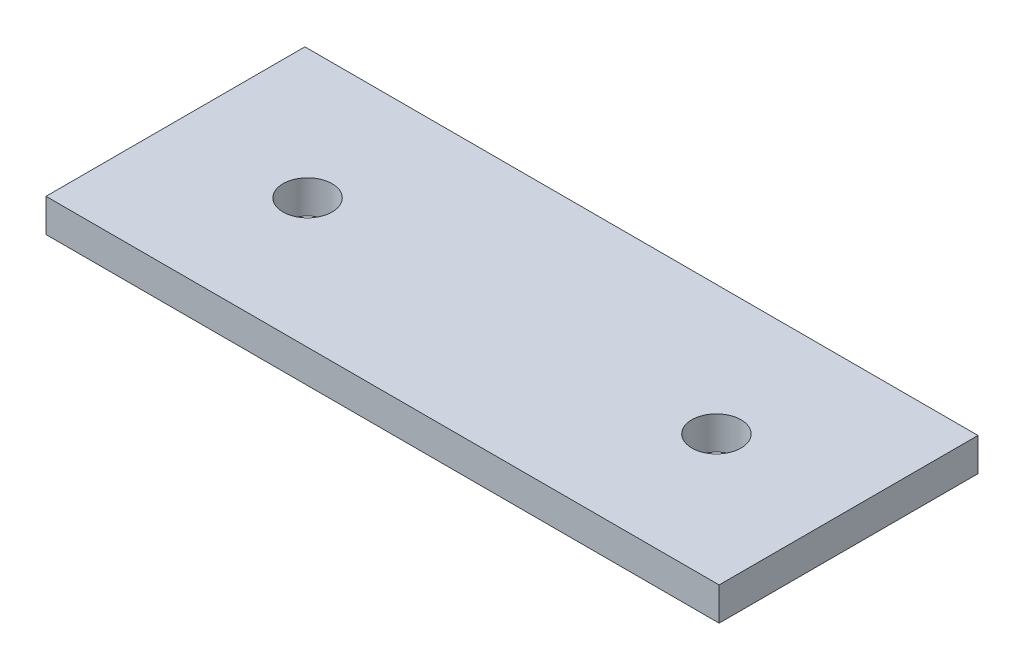
ISO-10303-21;
HEADER;
FILE_DESCRIPTION(('STEP AP214'),'2;1');
FILE_NAME('part.step','',(''),(''),'','','');
FILE_SCHEMA(('AUTOMOTIVE_DESIGN { 1 0 10303 214 1 1 1 1 }'));
ENDSEC;
DATA;
#1=APPLICATION_CONTEXT('core data for automotive mechanical design processes');
#2=APPLICATION_PROTOCOL_DEFINITION('international standard','automotive_design',2000,#1);
#3=PRODUCT_CONTEXT('',#1,'mechanical');
#4=PRODUCT('Part','Part','',(#3));
#5=PRODUCT_RELATED_PRODUCT_CATEGORY('part','',(#4));
#6=PRODUCT_DEFINITION_FORMATION('','',#4);
#7=PRODUCT_DEFINITION_CONTEXT('part definition',#1,'design');
#8=PRODUCT_DEFINITION('design','',#6,#7);
#9=PRODUCT_DEFINITION_SHAPE('','',#8);
#10=(LENGTH_UNIT() NAMED_UNIT(*) SI_UNIT(.MILLI.,.METRE.));
#11=(NAMED_UNIT(*) PLANE_ANGLE_UNIT() SI_UNIT($,.RADIAN.));
#12=(NAMED_UNIT(*) SI_UNIT($,.STERADIAN.) SOLID_ANGLE_UNIT());
#13=UNCERTAINTY_MEASURE_WITH_UNIT(LENGTH_MEASURE(1.E-05),#10,'distance_accuracy_value','');
#14=(GEOMETRIC_REPRESENTATION_CONTEXT(3) GLOBAL_UNCERTAINTY_ASSIGNED_CONTEXT((#13)) GLOBAL_UNIT_ASSIGNED_CONTEXT((#10,
#11,#12)) REPRESENTATION_CONTEXT('',''));
#15=CARTESIAN_POINT('',(0.,0.,0.));
#16=DIRECTION('',(0.,0.,1.));
#17=DIRECTION('',(1.,0.,0.));
#18=AXIS2_PLACEMENT_3D('',#15,#16,#17);
#19=CARTESIAN_POINT('',(-15.478125,1.524,5.953125));
#20=DIRECTION('',(1.,0.,0.));
#21=DIRECTION('',(0.,0.,-1.));
#22=AXIS2_PLACEMENT_3D('',#19,#20,#21);
#23=PLANE('',#22);
#24=DIRECTION('',(0.,0.,1.));
#25=VECTOR('',#24,1.);
#26=CARTESIAN_POINT('',(-15.478125,0.,5.953125));
#27=LINE('',#26,#25);
#28=CARTESIAN_POINT('',(-15.478125,0.,-5.953125));
#29=VERTEX_POINT('',#28);
#30=CARTESIAN_POINT('',(-15.478125,0.,5.953125));
#31=VERTEX_POINT('',#30);
#32=EDGE_CURVE('E98',#29,#31,#27,.T.);
#33=ORIENTED_EDGE('',*,*,#32,.T.);
#34=DIRECTION('',(0.,-1.,0.));
#35=VECTOR('',#34,1.);
#36=CARTESIAN_POINT('',(-15.478125,1.524,5.953125));
#37=LINE('',#36,#35);
#38=CARTESIAN_POINT('',(-15.478125,1.524,5.953125));
#39=VERTEX_POINT('',#38);
#40=EDGE_CURVE('E11',#39,#31,#37,.T.);
#41=ORIENTED_EDGE('',*,*,#40,.F.);
#42=DIRECTION('',(0.,0.,1.));
#43=VECTOR('',#42,1.);
#44=CARTESIAN_POINT('',(-15.478125,1.524,5.953125));
#45=LINE('',#44,#43);
#46=CARTESIAN_POINT('',(-15.478125,1.524,-5.953125));
#47=VERTEX_POINT('',#46);
#48=EDGE_CURVE('E86',#47,#39,#45,.T.);
#49=ORIENTED_EDGE('',*,*,#48,.F.);
#50=DIRECTION('',(0.,-1.,0.));
#51=VECTOR('',#50,1.);
#52=CARTESIAN_POINT('',(-15.478125,1.524,-5.953125));
#53=LINE('',#52,#51);
#54=EDGE_CURVE('E94',#47,#29,#53,.T.);
#55=ORIENTED_EDGE('',*,*,#54,.T.);
#56=EDGE_LOOP('',(#33,#41,#49,#55));
#57=FACE_BOUND('',#56,.T.);
#58=ADVANCED_FACE('F35',(#57),#23,.F.);
#59=CARTESIAN_POINT('',(15.478125,1.524,5.95312499999999));
#60=DIRECTION('',(0.,0.,-1.));
#61=DIRECTION('',(-1.,0.,0.));
#62=AXIS2_PLACEMENT_3D('',#59,#60,#61);
#63=PLANE('',#62);
#64=DIRECTION('',(1.,0.,0.));
#65=VECTOR('',#64,1.);
#66=CARTESIAN_POINT('',(15.478125,0.,5.95312499999999));
#67=LINE('',#66,#65);
#68=CARTESIAN_POINT('',(15.478125,0.,5.95312499999999));
#69=VERTEX_POINT('',#68);
#70=EDGE_CURVE('E90',#31,#69,#67,.T.);
#71=ORIENTED_EDGE('',*,*,#70,.T.);
#72=DIRECTION('',(0.,-1.,0.));
#73=VECTOR('',#72,1.);
#74=CARTESIAN_POINT('',(15.478125,1.524,5.95312499999999));
#75=LINE('',#74,#73);
#76=CARTESIAN_POINT('',(15.478125,1.524,5.95312499999999));
#77=VERTEX_POINT('',#76);
#78=EDGE_CURVE('E43',#77,#69,#75,.T.);
#79=ORIENTED_EDGE('',*,*,#78,.F.);
#80=DIRECTION('',(1.,0.,0.));
#81=VECTOR('',#80,1.);
#82=CARTESIAN_POINT('',(15.478125,1.524,5.95312499999999));
#83=LINE('',#82,#81);
#84=EDGE_CURVE('E81',#39,#77,#83,.T.);
#85=ORIENTED_EDGE('',*,*,#84,.F.);
#86=ORIENTED_EDGE('',*,*,#40,.T.);
#87=EDGE_LOOP('',(#71,#79,#85,#86));
#88=FACE_BOUND('',#87,.T.);
#89=ADVANCED_FACE('F89',(#88),#63,.F.);
#90=CARTESIAN_POINT('',(15.478125,1.524,5.95312499999999));
#91=DIRECTION('',(-1.,0.,0.));
#92=DIRECTION('',(0.,0.,1.));
#93=AXIS2_PLACEMENT_3D('',#90,#91,#92);
#94=PLANE('',#93);
#95=DIRECTION('',(0.,0.,-1.));
#96=VECTOR('',#95,1.);
#97=CARTESIAN_POINT('',(15.478125,0.,5.95312499999999));
#98=LINE('',#97,#96);
#99=CARTESIAN_POINT('',(15.478125,0.,-5.953125));
#100=VERTEX_POINT('',#99);
#101=EDGE_CURVE('E68',#69,#100,#98,.T.);
#102=ORIENTED_EDGE('',*,*,#101,.T.);
#103=DIRECTION('',(0.,-1.,0.));
#104=VECTOR('',#103,1.);
#105=CARTESIAN_POINT('',(15.478125,1.524,-5.953125));
#106=LINE('',#105,#104);
#107=CARTESIAN_POINT('',(15.478125,1.524,-5.953125));
#108=VERTEX_POINT('',#107);
#109=EDGE_CURVE('E91',#108,#100,#106,.T.);
#110=ORIENTED_EDGE('',*,*,#109,.F.);
#111=DIRECTION('',(0.,0.,-1.));
#112=VECTOR('',#111,1.);
#113=CARTESIAN_POINT('',(15.478125,1.524,5.95312499999999));
#114=LINE('',#113,#112);
#115=EDGE_CURVE('E84',#77,#108,#114,.T.);
#116=ORIENTED_EDGE('',*,*,#115,.F.);
#117=ORIENTED_EDGE('',*,*,#78,.T.);
#118=EDGE_LOOP('',(#102,#110,#116,#117));
#119=FACE_BOUND('',#118,.T.);
#120=ADVANCED_FACE('F92',(#119),#94,.F.);
#121=CARTESIAN_POINT('',(15.478125,1.524,-5.953125));
#122=DIRECTION('',(0.,0.,1.));
#123=DIRECTION('',(1.,0.,0.));
#124=AXIS2_PLACEMENT_3D('',#121,#122,#123);
#125=PLANE('',#124);
#126=DIRECTION('',(-1.,0.,0.));
#127=VECTOR('',#126,1.);
#128=CARTESIAN_POINT('',(15.478125,0.,-5.953125));
#129=LINE('',#128,#127);
#130=EDGE_CURVE('E74',#100,#29,#129,.T.);
#131=ORIENTED_EDGE('',*,*,#130,.T.);
#132=ORIENTED_EDGE('',*,*,#54,.F.);
#133=DIRECTION('',(-1.,0.,0.));
#134=VECTOR('',#133,1.);
#135=CARTESIAN_POINT('',(15.478125,1.524,-5.953125));
#136=LINE('',#135,#134);
#137=EDGE_CURVE('E51',#108,#47,#136,.T.);
#138=ORIENTED_EDGE('',*,*,#137,.F.);
#139=ORIENTED_EDGE('',*,*,#109,.T.);
#140=EDGE_LOOP('',(#131,#132,#138,#139));
#141=FACE_BOUND('',#140,.T.);
#142=ADVANCED_FACE('F106',(#141),#125,.F.);
#143=CARTESIAN_POINT('',(-15.478125,1.524,-5.953125));
#144=DIRECTION('',(0.,1.,0.));
#145=DIRECTION('',(0.,0.,1.));
#146=AXIS2_PLACEMENT_3D('',#143,#144,#145);
#147=PLANE('',#146);
#148=CARTESIAN_POINT('',(-9.4020222441884,1.524,0.));
#149=DIRECTION('',(0.,1.,0.));
#150=DIRECTION('',(0.,0.,1.));
#151=AXIS2_PLACEMENT_3D('',#148,#149,#150);
#152=CIRCLE('',#151,1.13029999999999);
#153=CARTESIAN_POINT('',(-9.4020222441884,1.524,1.13029999999999));
#154=VERTEX_POINT('',#153);
#155=EDGE_CURVE('E120',#154,#154,#152,.T.);
#156=ORIENTED_EDGE('',*,*,#155,.F.);
#157=EDGE_LOOP('',(#156));
#158=FACE_BOUND('',#157,.T.);
#159=CARTESIAN_POINT('',(9.4020222441884,1.524,0.));
#160=DIRECTION('',(0.,1.,0.));
#161=DIRECTION('',(0.,0.,1.));
#162=AXIS2_PLACEMENT_3D('',#159,#160,#161);
#163=CIRCLE('',#162,1.13029999999999);
#164=CARTESIAN_POINT('',(9.4020222441884,1.524,1.13029999999999));
#165=VERTEX_POINT('',#164);
#166=EDGE_CURVE('E114',#165,#165,#163,.T.);
#167=ORIENTED_EDGE('',*,*,#166,.F.);
#168=EDGE_LOOP('',(#167));
#169=FACE_BOUND('',#168,.T.);
#170=ORIENTED_EDGE('',*,*,#48,.T.);
#171=ORIENTED_EDGE('',*,*,#84,.T.);
#172=ORIENTED_EDGE('',*,*,#115,.T.);
#173=ORIENTED_EDGE('',*,*,#137,.T.);
#174=EDGE_LOOP('',(#170,#171,#172,#173));
#175=FACE_BOUND('',#174,.T.);
#176=ADVANCED_FACE('F82',(#158,#169,#175),#147,.T.);
#177=CARTESIAN_POINT('',(-15.478125,0.,-5.953125));
#178=DIRECTION('',(0.,1.,0.));
#179=DIRECTION('',(0.,0.,1.));
#180=AXIS2_PLACEMENT_3D('',#177,#178,#179);
#181=PLANE('',#180);
#182=CARTESIAN_POINT('',(-9.4020222441884,0.,0.));
#183=DIRECTION('',(0.,1.,0.));
#184=DIRECTION('',(0.,0.,1.));
#185=AXIS2_PLACEMENT_3D('',#182,#183,#184);
#186=CIRCLE('',#185,1.13029999999999);
#187=CARTESIAN_POINT('',(-9.4020222441884,0.,1.13029999999999));
#188=VERTEX_POINT('',#187);
#189=EDGE_CURVE('E117',#188,#188,#186,.T.);
#190=ORIENTED_EDGE('',*,*,#189,.T.);
#191=EDGE_LOOP('',(#190));
#192=FACE_BOUND('',#191,.T.);
#193=CARTESIAN_POINT('',(9.4020222441884,0.,0.));
#194=DIRECTION('',(0.,1.,0.));
#195=DIRECTION('',(0.,0.,1.));
#196=AXIS2_PLACEMENT_3D('',#193,#194,#195);
#197=CIRCLE('',#196,1.13029999999999);
#198=CARTESIAN_POINT('',(9.4020222441884,0.,1.13029999999999));
#199=VERTEX_POINT('',#198);
#200=EDGE_CURVE('E101',#199,#199,#197,.T.);
#201=ORIENTED_EDGE('',*,*,#200,.T.);
#202=EDGE_LOOP('',(#201));
#203=FACE_BOUND('',#202,.T.);
#204=ORIENTED_EDGE('',*,*,#32,.F.);
#205=ORIENTED_EDGE('',*,*,#130,.F.);
#206=ORIENTED_EDGE('',*,*,#101,.F.);
#207=ORIENTED_EDGE('',*,*,#70,.F.);
#208=EDGE_LOOP('',(#204,#205,#206,#207));
#209=FACE_BOUND('',#208,.T.);
#210=ADVANCED_FACE('F109',(#192,#203,#209),#181,.F.);
#211=CARTESIAN_POINT('',(9.4020222441884,1.524,0.));
#212=DIRECTION('',(0.,1.,0.));
#213=DIRECTION('',(0.,0.,1.));
#214=AXIS2_PLACEMENT_3D('',#211,#212,#213);
#215=CYLINDRICAL_SURFACE('',#214,1.13029999999999);
#216=ORIENTED_EDGE('',*,*,#166,.T.);
#217=EDGE_LOOP('',(#216));
#218=FACE_BOUND('',#217,.T.);
#219=ORIENTED_EDGE('',*,*,#200,.F.);
#220=EDGE_LOOP('',(#219));
#221=FACE_BOUND('',#220,.T.);
#222=ADVANCED_FACE('F132',(#218,#221),#215,.F.);
#223=CARTESIAN_POINT('',(-9.4020222441884,1.524,0.));
#224=DIRECTION('',(0.,1.,0.));
#225=DIRECTION('',(0.,0.,1.));
#226=AXIS2_PLACEMENT_3D('',#223,#224,#225);
#227=CYLINDRICAL_SURFACE('',#226,1.13029999999999);
#228=ORIENTED_EDGE('',*,*,#155,.T.);
#229=EDGE_LOOP('',(#228));
#230=FACE_BOUND('',#229,.T.);
#231=ORIENTED_EDGE('',*,*,#189,.F.);
#232=EDGE_LOOP('',(#231));
#233=FACE_BOUND('',#232,.T.);
#234=ADVANCED_FACE('F124',(#230,#233),#227,.F.);
#235=CLOSED_SHELL('',(#58,#89,#120,#142,#176,#210,#222,#234));
#236=MANIFOLD_SOLID_BREP('B2',#235);
#237=ADVANCED_BREP_SHAPE_REPRESENTATION('',(#18,#236),#14);
#238=SHAPE_DEFINITION_REPRESENTATION(#9,#237);
ENDSEC;
END-ISO-10303-21;
